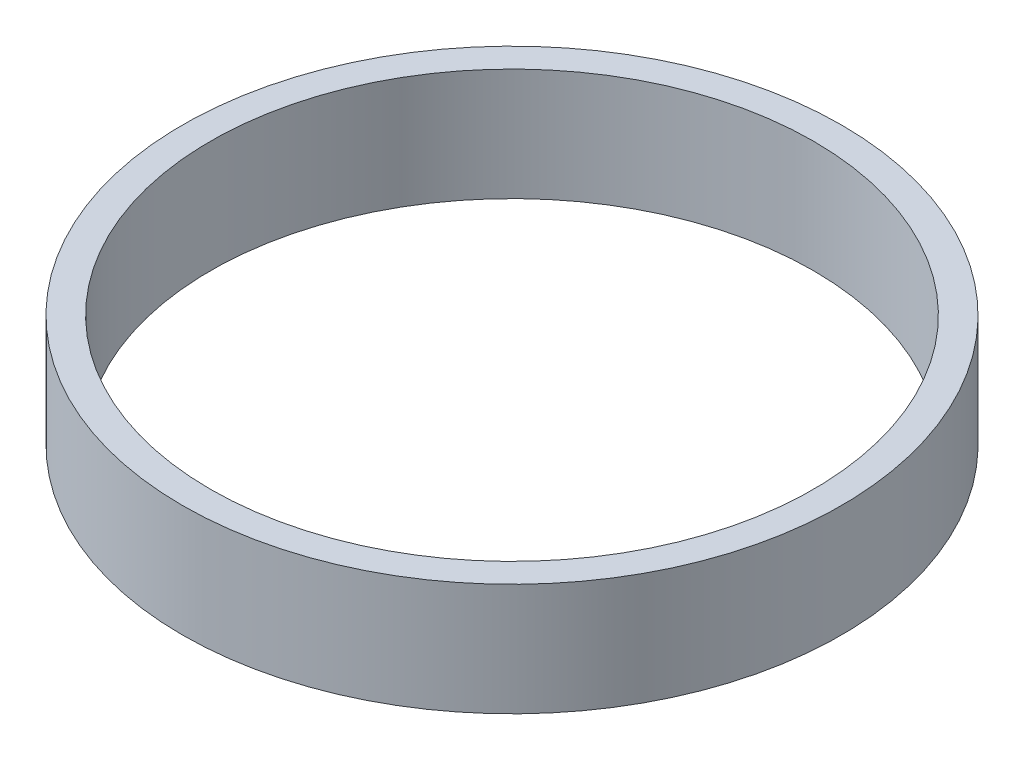
ISO-10303-21;
HEADER;
FILE_DESCRIPTION(('STEP AP214'),'2;1');
FILE_NAME('part.step','',(''),(''),'','','');
FILE_SCHEMA(('AUTOMOTIVE_DESIGN { 1 0 10303 214 1 1 1 1 }'));
ENDSEC;
DATA;
#1=APPLICATION_CONTEXT('core data for automotive mechanical design processes');
#2=APPLICATION_PROTOCOL_DEFINITION('international standard','automotive_design',2000,#1);
#3=PRODUCT_CONTEXT('',#1,'mechanical');
#4=PRODUCT('Part','Part','',(#3));
#5=PRODUCT_RELATED_PRODUCT_CATEGORY('part','',(#4));
#6=PRODUCT_DEFINITION_FORMATION('','',#4);
#7=PRODUCT_DEFINITION_CONTEXT('part definition',#1,'design');
#8=PRODUCT_DEFINITION('design','',#6,#7);
#9=PRODUCT_DEFINITION_SHAPE('','',#8);
#10=(LENGTH_UNIT() NAMED_UNIT(*) SI_UNIT(.MILLI.,.METRE.));
#11=(NAMED_UNIT(*) PLANE_ANGLE_UNIT() SI_UNIT($,.RADIAN.));
#12=(NAMED_UNIT(*) SI_UNIT($,.STERADIAN.) SOLID_ANGLE_UNIT());
#13=UNCERTAINTY_MEASURE_WITH_UNIT(LENGTH_MEASURE(1.E-05),#10,'distance_accuracy_value','');
#14=(GEOMETRIC_REPRESENTATION_CONTEXT(3) GLOBAL_UNCERTAINTY_ASSIGNED_CONTEXT((#13)) GLOBAL_UNIT_ASSIGNED_CONTEXT((#10,
#11,#12)) REPRESENTATION_CONTEXT('',''));
#15=CARTESIAN_POINT('',(0.,0.,0.));
#16=DIRECTION('',(0.,0.,1.));
#17=DIRECTION('',(1.,0.,0.));
#18=AXIS2_PLACEMENT_3D('',#15,#16,#17);
#19=CARTESIAN_POINT('',(0.,203.2,0.));
#20=DIRECTION('',(0.,1.,0.));
#21=DIRECTION('',(0.,0.,1.));
#22=AXIS2_PLACEMENT_3D('',#19,#20,#21);
#23=PLANE('',#22);
#24=CARTESIAN_POINT('',(0.,203.2,0.));
#25=DIRECTION('',(0.,1.,0.));
#26=DIRECTION('',(0.,0.,1.));
#27=AXIS2_PLACEMENT_3D('',#24,#25,#26);
#28=CIRCLE('',#27,1193.8);
#29=CARTESIAN_POINT('',(0.,203.2,1193.8));
#30=VERTEX_POINT('',#29);
#31=EDGE_CURVE('E10',#30,#30,#28,.T.);
#32=ORIENTED_EDGE('',*,*,#31,.T.);
#33=EDGE_LOOP('',(#32));
#34=FACE_BOUND('',#33,.T.);
#35=CARTESIAN_POINT('',(0.,203.2,0.));
#36=DIRECTION('',(0.,1.,0.));
#37=DIRECTION('',(0.,0.,1.));
#38=AXIS2_PLACEMENT_3D('',#35,#36,#37);
#39=CIRCLE('',#38,1092.2);
#40=CARTESIAN_POINT('',(0.,203.2,1092.2));
#41=VERTEX_POINT('',#40);
#42=EDGE_CURVE('E50',#41,#41,#39,.T.);
#43=ORIENTED_EDGE('',*,*,#42,.F.);
#44=EDGE_LOOP('',(#43));
#45=FACE_BOUND('',#44,.T.);
#46=ADVANCED_FACE('F37',(#34,#45),#23,.T.);
#47=CARTESIAN_POINT('',(0.,-203.2,0.));
#48=DIRECTION('',(0.,1.,0.));
#49=DIRECTION('',(0.,0.,1.));
#50=AXIS2_PLACEMENT_3D('',#47,#48,#49);
#51=PLANE('',#50);
#52=CARTESIAN_POINT('',(0.,-203.2,0.));
#53=DIRECTION('',(0.,1.,0.));
#54=DIRECTION('',(0.,0.,1.));
#55=AXIS2_PLACEMENT_3D('',#52,#53,#54);
#56=CIRCLE('',#55,1193.8);
#57=CARTESIAN_POINT('',(0.,-203.2,1193.8));
#58=VERTEX_POINT('',#57);
#59=EDGE_CURVE('E41',#58,#58,#56,.T.);
#60=ORIENTED_EDGE('',*,*,#59,.F.);
#61=EDGE_LOOP('',(#60));
#62=FACE_BOUND('',#61,.T.);
#63=CARTESIAN_POINT('',(0.,-203.2,0.));
#64=DIRECTION('',(0.,1.,0.));
#65=DIRECTION('',(0.,0.,1.));
#66=AXIS2_PLACEMENT_3D('',#63,#64,#65);
#67=CIRCLE('',#66,1092.2);
#68=CARTESIAN_POINT('',(0.,-203.2,1092.2));
#69=VERTEX_POINT('',#68);
#70=EDGE_CURVE('E52',#69,#69,#67,.T.);
#71=ORIENTED_EDGE('',*,*,#70,.T.);
#72=EDGE_LOOP('',(#71));
#73=FACE_BOUND('',#72,.T.);
#74=ADVANCED_FACE('F64',(#62,#73),#51,.F.);
#75=CARTESIAN_POINT('',(0.,203.2,0.));
#76=DIRECTION('',(0.,-1.,0.));
#77=DIRECTION('',(0.,0.,-1.));
#78=AXIS2_PLACEMENT_3D('',#75,#76,#77);
#79=CYLINDRICAL_SURFACE('',#78,1193.8);
#80=ORIENTED_EDGE('',*,*,#31,.F.);
#81=EDGE_LOOP('',(#80));
#82=FACE_BOUND('',#81,.T.);
#83=ORIENTED_EDGE('',*,*,#59,.T.);
#84=EDGE_LOOP('',(#83));
#85=FACE_BOUND('',#84,.T.);
#86=ADVANCED_FACE('F39',(#82,#85),#79,.T.);
#87=CARTESIAN_POINT('',(0.,203.2,0.));
#88=DIRECTION('',(0.,-1.,0.));
#89=DIRECTION('',(0.,0.,-1.));
#90=AXIS2_PLACEMENT_3D('',#87,#88,#89);
#91=CYLINDRICAL_SURFACE('',#90,1092.2);
#92=ORIENTED_EDGE('',*,*,#42,.T.);
#93=EDGE_LOOP('',(#92));
#94=FACE_BOUND('',#93,.T.);
#95=ORIENTED_EDGE('',*,*,#70,.F.);
#96=EDGE_LOOP('',(#95));
#97=FACE_BOUND('',#96,.T.);
#98=ADVANCED_FACE('F60',(#94,#97),#91,.F.);
#99=CLOSED_SHELL('',(#46,#74,#86,#98));
#100=MANIFOLD_SOLID_BREP('B2',#99);
#101=ADVANCED_BREP_SHAPE_REPRESENTATION('',(#18,#100),#14);
#102=SHAPE_DEFINITION_REPRESENTATION(#9,#101);
ENDSEC;
END-ISO-10303-21;
